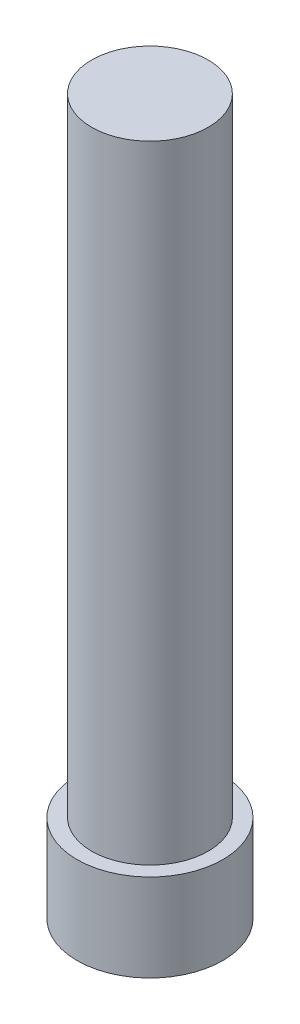
ISO-10303-21;
HEADER;
FILE_DESCRIPTION(('STEP AP214'),'2;1');
FILE_NAME('part.step','',(''),(''),'','','');
FILE_SCHEMA(('AUTOMOTIVE_DESIGN { 1 0 10303 214 1 1 1 1 }'));
ENDSEC;
DATA;
#1=APPLICATION_CONTEXT('core data for automotive mechanical design processes');
#2=APPLICATION_PROTOCOL_DEFINITION('international standard','automotive_design',2000,#1);
#3=PRODUCT_CONTEXT('',#1,'mechanical');
#4=PRODUCT('Part','Part','',(#3));
#5=PRODUCT_RELATED_PRODUCT_CATEGORY('part','',(#4));
#6=PRODUCT_DEFINITION_FORMATION('','',#4);
#7=PRODUCT_DEFINITION_CONTEXT('part definition',#1,'design');
#8=PRODUCT_DEFINITION('design','',#6,#7);
#9=PRODUCT_DEFINITION_SHAPE('','',#8);
#10=(LENGTH_UNIT() NAMED_UNIT(*) SI_UNIT(.MILLI.,.METRE.));
#11=(NAMED_UNIT(*) PLANE_ANGLE_UNIT() SI_UNIT($,.RADIAN.));
#12=(NAMED_UNIT(*) SI_UNIT($,.STERADIAN.) SOLID_ANGLE_UNIT());
#13=UNCERTAINTY_MEASURE_WITH_UNIT(LENGTH_MEASURE(1.E-05),#10,'distance_accuracy_value','');
#14=(GEOMETRIC_REPRESENTATION_CONTEXT(3) GLOBAL_UNCERTAINTY_ASSIGNED_CONTEXT((#13)) GLOBAL_UNIT_ASSIGNED_CONTEXT((#10,
#11,#12)) REPRESENTATION_CONTEXT('',''));
#15=CARTESIAN_POINT('',(0.,0.,0.));
#16=DIRECTION('',(0.,0.,1.));
#17=DIRECTION('',(1.,0.,0.));
#18=AXIS2_PLACEMENT_3D('',#15,#16,#17);
#19=CARTESIAN_POINT('',(0.,6.,0.));
#20=DIRECTION('',(0.,-1.,0.));
#21=DIRECTION('',(0.,0.,-1.));
#22=AXIS2_PLACEMENT_3D('',#19,#20,#21);
#23=CYLINDRICAL_SURFACE('',#22,5.);
#24=CARTESIAN_POINT('',(0.,6.,0.));
#25=DIRECTION('',(0.,1.,0.));
#26=DIRECTION('',(0.,0.,1.));
#27=AXIS2_PLACEMENT_3D('',#24,#25,#26);
#28=CIRCLE('',#27,5.);
#29=CARTESIAN_POINT('',(0.,6.,5.));
#30=VERTEX_POINT('',#29);
#31=EDGE_CURVE('E42',#30,#30,#28,.T.);
#32=ORIENTED_EDGE('',*,*,#31,.F.);
#33=EDGE_LOOP('',(#32));
#34=FACE_BOUND('',#33,.T.);
#35=CARTESIAN_POINT('',(0.,0.,0.));
#36=DIRECTION('',(0.,1.,0.));
#37=DIRECTION('',(0.,0.,1.));
#38=AXIS2_PLACEMENT_3D('',#35,#36,#37);
#39=CIRCLE('',#38,5.);
#40=CARTESIAN_POINT('',(0.,0.,5.));
#41=VERTEX_POINT('',#40);
#42=EDGE_CURVE('E37',#41,#41,#39,.T.);
#43=ORIENTED_EDGE('',*,*,#42,.T.);
#44=EDGE_LOOP('',(#43));
#45=FACE_BOUND('',#44,.T.);
#46=ADVANCED_FACE('F34',(#34,#45),#23,.T.);
#47=CARTESIAN_POINT('',(0.,6.,0.));
#48=DIRECTION('',(0.,1.,0.));
#49=DIRECTION('',(0.,0.,1.));
#50=AXIS2_PLACEMENT_3D('',#47,#48,#49);
#51=PLANE('',#50);
#52=CARTESIAN_POINT('',(0.,6.,0.));
#53=DIRECTION('',(0.,1.,0.));
#54=DIRECTION('',(0.,0.,1.));
#55=AXIS2_PLACEMENT_3D('',#52,#53,#54);
#56=CIRCLE('',#55,4.);
#57=CARTESIAN_POINT('',(0.,6.,4.));
#58=VERTEX_POINT('',#57);
#59=EDGE_CURVE('E11',#58,#58,#56,.T.);
#60=ORIENTED_EDGE('',*,*,#59,.F.);
#61=EDGE_LOOP('',(#60));
#62=FACE_BOUND('',#61,.T.);
#63=ORIENTED_EDGE('',*,*,#31,.T.);
#64=EDGE_LOOP('',(#63));
#65=FACE_BOUND('',#64,.T.);
#66=ADVANCED_FACE('F154',(#62,#65),#51,.T.);
#67=CARTESIAN_POINT('',(0.,0.,0.));
#68=DIRECTION('',(0.,1.,0.));
#69=DIRECTION('',(0.,0.,1.));
#70=AXIS2_PLACEMENT_3D('',#67,#68,#69);
#71=PLANE('',#70);
#72=DIRECTION('',(-0.5,0.,0.866025403784439));
#73=VECTOR('',#72,1.);
#74=CARTESIAN_POINT('',(3.46410161513776,0.,0.));
#75=LINE('',#74,#73);
#76=CARTESIAN_POINT('',(3.46410161513776,0.,0.));
#77=VERTEX_POINT('',#76);
#78=CARTESIAN_POINT('',(1.73205080756888,0.,3.));
#79=VERTEX_POINT('',#78);
#80=EDGE_CURVE('E124',#77,#79,#75,.T.);
#81=ORIENTED_EDGE('',*,*,#80,.F.);
#82=DIRECTION('',(0.5,0.,0.866025403784439));
#83=VECTOR('',#82,1.);
#84=CARTESIAN_POINT('',(1.73205080756888,0.,-3.));
#85=LINE('',#84,#83);
#86=CARTESIAN_POINT('',(1.73205080756888,0.,-3.));
#87=VERTEX_POINT('',#86);
#88=EDGE_CURVE('E50',#87,#77,#85,.T.);
#89=ORIENTED_EDGE('',*,*,#88,.F.);
#90=DIRECTION('',(1.,0.,0.));
#91=VECTOR('',#90,1.);
#92=CARTESIAN_POINT('',(-1.73205080756888,0.,-3.));
#93=LINE('',#92,#91);
#94=CARTESIAN_POINT('',(-1.73205080756888,0.,-3.));
#95=VERTEX_POINT('',#94);
#96=EDGE_CURVE('E133',#95,#87,#93,.T.);
#97=ORIENTED_EDGE('',*,*,#96,.F.);
#98=DIRECTION('',(0.5,0.,-0.866025403784439));
#99=VECTOR('',#98,1.);
#100=CARTESIAN_POINT('',(-3.46410161513776,0.,0.));
#101=LINE('',#100,#99);
#102=CARTESIAN_POINT('',(-3.46410161513776,0.,0.));
#103=VERTEX_POINT('',#102);
#104=EDGE_CURVE('E131',#103,#95,#101,.T.);
#105=ORIENTED_EDGE('',*,*,#104,.F.);
#106=DIRECTION('',(-0.5,0.,-0.866025403784439));
#107=VECTOR('',#106,1.);
#108=CARTESIAN_POINT('',(-1.73205080756888,0.,3.));
#109=LINE('',#108,#107);
#110=CARTESIAN_POINT('',(-1.73205080756888,0.,3.));
#111=VERTEX_POINT('',#110);
#112=EDGE_CURVE('E98',#111,#103,#109,.T.);
#113=ORIENTED_EDGE('',*,*,#112,.F.);
#114=DIRECTION('',(-1.,0.,0.));
#115=VECTOR('',#114,1.);
#116=CARTESIAN_POINT('',(1.73205080756888,0.,3.));
#117=LINE('',#116,#115);
#118=EDGE_CURVE('E127',#79,#111,#117,.T.);
#119=ORIENTED_EDGE('',*,*,#118,.F.);
#120=EDGE_LOOP('',(#81,#89,#97,#105,#113,#119));
#121=FACE_BOUND('',#120,.T.);
#122=ORIENTED_EDGE('',*,*,#42,.F.);
#123=EDGE_LOOP('',(#122));
#124=FACE_BOUND('',#123,.T.);
#125=ADVANCED_FACE('F151',(#121,#124),#71,.F.);
#126=CARTESIAN_POINT('',(0.,49.,0.));
#127=DIRECTION('',(0.,-1.,0.));
#128=DIRECTION('',(0.,0.,-1.));
#129=AXIS2_PLACEMENT_3D('',#126,#127,#128);
#130=CYLINDRICAL_SURFACE('',#129,4.);
#131=CARTESIAN_POINT('',(0.,49.,0.));
#132=DIRECTION('',(0.,1.,0.));
#133=DIRECTION('',(0.,0.,1.));
#134=AXIS2_PLACEMENT_3D('',#131,#132,#133);
#135=CIRCLE('',#134,4.);
#136=CARTESIAN_POINT('',(0.,49.,4.));
#137=VERTEX_POINT('',#136);
#138=EDGE_CURVE('E137',#137,#137,#135,.T.);
#139=ORIENTED_EDGE('',*,*,#138,.F.);
#140=EDGE_LOOP('',(#139));
#141=FACE_BOUND('',#140,.T.);
#142=ORIENTED_EDGE('',*,*,#59,.T.);
#143=EDGE_LOOP('',(#142));
#144=FACE_BOUND('',#143,.T.);
#145=ADVANCED_FACE('F153',(#141,#144),#130,.T.);
#146=CARTESIAN_POINT('',(0.,49.,0.));
#147=DIRECTION('',(0.,1.,0.));
#148=DIRECTION('',(0.,0.,1.));
#149=AXIS2_PLACEMENT_3D('',#146,#147,#148);
#150=PLANE('',#149);
#151=ORIENTED_EDGE('',*,*,#138,.T.);
#152=EDGE_LOOP('',(#151));
#153=FACE_BOUND('',#152,.T.);
#154=ADVANCED_FACE('F160',(#153),#150,.T.);
#155=CARTESIAN_POINT('',(1.73205080756888,3.5,-3.));
#156=DIRECTION('',(0.866025403784439,0.,-0.5));
#157=DIRECTION('',(-0.5,0.,-0.866025403784439));
#158=AXIS2_PLACEMENT_3D('',#155,#156,#157);
#159=PLANE('',#158);
#160=ORIENTED_EDGE('',*,*,#88,.T.);
#161=DIRECTION('',(0.,-1.,0.));
#162=VECTOR('',#161,1.);
#163=CARTESIAN_POINT('',(3.46410161513776,3.5,0.));
#164=LINE('',#163,#162);
#165=CARTESIAN_POINT('',(3.46410161513776,3.5,0.));
#166=VERTEX_POINT('',#165);
#167=EDGE_CURVE('E80',#166,#77,#164,.T.);
#168=ORIENTED_EDGE('',*,*,#167,.F.);
#169=DIRECTION('',(0.5,0.,0.866025403784439));
#170=VECTOR('',#169,1.);
#171=CARTESIAN_POINT('',(1.73205080756888,3.5,-3.));
#172=LINE('',#171,#170);
#173=CARTESIAN_POINT('',(1.73205080756888,3.5,-3.));
#174=VERTEX_POINT('',#173);
#175=EDGE_CURVE('E135',#174,#166,#172,.T.);
#176=ORIENTED_EDGE('',*,*,#175,.F.);
#177=DIRECTION('',(0.,-1.,0.));
#178=VECTOR('',#177,1.);
#179=CARTESIAN_POINT('',(1.73205080756888,3.5,-3.));
#180=LINE('',#179,#178);
#181=EDGE_CURVE('E58',#174,#87,#180,.T.);
#182=ORIENTED_EDGE('',*,*,#181,.T.);
#183=EDGE_LOOP('',(#160,#168,#176,#182));
#184=FACE_BOUND('',#183,.T.);
#185=ADVANCED_FACE('F189',(#184),#159,.F.);
#186=CARTESIAN_POINT('',(-1.73205080756888,3.5,-3.));
#187=DIRECTION('',(0.,0.,-1.));
#188=DIRECTION('',(-1.,0.,0.));
#189=AXIS2_PLACEMENT_3D('',#186,#187,#188);
#190=PLANE('',#189);
#191=ORIENTED_EDGE('',*,*,#96,.T.);
#192=ORIENTED_EDGE('',*,*,#181,.F.);
#193=DIRECTION('',(1.,0.,0.));
#194=VECTOR('',#193,1.);
#195=CARTESIAN_POINT('',(-1.73205080756888,3.5,-3.));
#196=LINE('',#195,#194);
#197=CARTESIAN_POINT('',(-1.73205080756888,3.5,-3.));
#198=VERTEX_POINT('',#197);
#199=EDGE_CURVE('E110',#198,#174,#196,.T.);
#200=ORIENTED_EDGE('',*,*,#199,.F.);
#201=DIRECTION('',(0.,-1.,0.));
#202=VECTOR('',#201,1.);
#203=CARTESIAN_POINT('',(-1.73205080756888,3.5,-3.));
#204=LINE('',#203,#202);
#205=EDGE_CURVE('E102',#198,#95,#204,.T.);
#206=ORIENTED_EDGE('',*,*,#205,.T.);
#207=EDGE_LOOP('',(#191,#192,#200,#206));
#208=FACE_BOUND('',#207,.T.);
#209=ADVANCED_FACE('F203',(#208),#190,.F.);
#210=CARTESIAN_POINT('',(-3.46410161513776,3.5,0.));
#211=DIRECTION('',(-0.866025403784439,0.,-0.5));
#212=DIRECTION('',(-0.5,0.,0.866025403784439));
#213=AXIS2_PLACEMENT_3D('',#210,#211,#212);
#214=PLANE('',#213);
#215=ORIENTED_EDGE('',*,*,#104,.T.);
#216=ORIENTED_EDGE('',*,*,#205,.F.);
#217=DIRECTION('',(0.5,0.,-0.866025403784439));
#218=VECTOR('',#217,1.);
#219=CARTESIAN_POINT('',(-3.46410161513776,3.5,0.));
#220=LINE('',#219,#218);
#221=CARTESIAN_POINT('',(-3.46410161513776,3.5,0.));
#222=VERTEX_POINT('',#221);
#223=EDGE_CURVE('E106',#222,#198,#220,.T.);
#224=ORIENTED_EDGE('',*,*,#223,.F.);
#225=DIRECTION('',(0.,-1.,0.));
#226=VECTOR('',#225,1.);
#227=CARTESIAN_POINT('',(-3.46410161513776,3.5,0.));
#228=LINE('',#227,#226);
#229=EDGE_CURVE('E91',#222,#103,#228,.T.);
#230=ORIENTED_EDGE('',*,*,#229,.T.);
#231=EDGE_LOOP('',(#215,#216,#224,#230));
#232=FACE_BOUND('',#231,.T.);
#233=ADVANCED_FACE('F107',(#232),#214,.F.);
#234=CARTESIAN_POINT('',(-1.73205080756888,3.5,3.));
#235=DIRECTION('',(-0.866025403784439,0.,0.5));
#236=DIRECTION('',(0.5,0.,0.866025403784439));
#237=AXIS2_PLACEMENT_3D('',#234,#235,#236);
#238=PLANE('',#237);
#239=ORIENTED_EDGE('',*,*,#112,.T.);
#240=ORIENTED_EDGE('',*,*,#229,.F.);
#241=DIRECTION('',(-0.5,0.,-0.866025403784439));
#242=VECTOR('',#241,1.);
#243=CARTESIAN_POINT('',(-1.73205080756888,3.5,3.));
#244=LINE('',#243,#242);
#245=CARTESIAN_POINT('',(-1.73205080756888,3.5,3.));
#246=VERTEX_POINT('',#245);
#247=EDGE_CURVE('E95',#246,#222,#244,.T.);
#248=ORIENTED_EDGE('',*,*,#247,.F.);
#249=DIRECTION('',(0.,-1.,0.));
#250=VECTOR('',#249,1.);
#251=CARTESIAN_POINT('',(-1.73205080756888,3.5,3.));
#252=LINE('',#251,#250);
#253=EDGE_CURVE('E103',#246,#111,#252,.T.);
#254=ORIENTED_EDGE('',*,*,#253,.T.);
#255=EDGE_LOOP('',(#239,#240,#248,#254));
#256=FACE_BOUND('',#255,.T.);
#257=ADVANCED_FACE('F93',(#256),#238,.F.);
#258=CARTESIAN_POINT('',(1.73205080756888,3.5,3.));
#259=DIRECTION('',(0.,0.,1.));
#260=DIRECTION('',(1.,0.,0.));
#261=AXIS2_PLACEMENT_3D('',#258,#259,#260);
#262=PLANE('',#261);
#263=ORIENTED_EDGE('',*,*,#118,.T.);
#264=ORIENTED_EDGE('',*,*,#253,.F.);
#265=DIRECTION('',(-1.,0.,0.));
#266=VECTOR('',#265,1.);
#267=CARTESIAN_POINT('',(1.73205080756888,3.5,3.));
#268=LINE('',#267,#266);
#269=CARTESIAN_POINT('',(1.73205080756888,3.5,3.));
#270=VERTEX_POINT('',#269);
#271=EDGE_CURVE('E116',#270,#246,#268,.T.);
#272=ORIENTED_EDGE('',*,*,#271,.F.);
#273=DIRECTION('',(0.,-1.,0.));
#274=VECTOR('',#273,1.);
#275=CARTESIAN_POINT('',(1.73205080756888,3.5,3.));
#276=LINE('',#275,#274);
#277=EDGE_CURVE('E140',#270,#79,#276,.T.);
#278=ORIENTED_EDGE('',*,*,#277,.T.);
#279=EDGE_LOOP('',(#263,#264,#272,#278));
#280=FACE_BOUND('',#279,.T.);
#281=ADVANCED_FACE('F228',(#280),#262,.F.);
#282=CARTESIAN_POINT('',(3.46410161513776,3.5,0.));
#283=DIRECTION('',(0.866025403784438,0.,0.5));
#284=DIRECTION('',(0.5,0.,-0.866025403784439));
#285=AXIS2_PLACEMENT_3D('',#282,#283,#284);
#286=PLANE('',#285);
#287=ORIENTED_EDGE('',*,*,#80,.T.);
#288=ORIENTED_EDGE('',*,*,#277,.F.);
#289=DIRECTION('',(-0.5,0.,0.866025403784439));
#290=VECTOR('',#289,1.);
#291=CARTESIAN_POINT('',(3.46410161513776,3.5,0.));
#292=LINE('',#291,#290);
#293=EDGE_CURVE('E118',#166,#270,#292,.T.);
#294=ORIENTED_EDGE('',*,*,#293,.F.);
#295=ORIENTED_EDGE('',*,*,#167,.T.);
#296=EDGE_LOOP('',(#287,#288,#294,#295));
#297=FACE_BOUND('',#296,.T.);
#298=ADVANCED_FACE('F237',(#297),#286,.F.);
#299=CARTESIAN_POINT('',(0.,3.5,0.));
#300=DIRECTION('',(0.,-1.,0.));
#301=DIRECTION('',(0.,0.,-1.));
#302=AXIS2_PLACEMENT_3D('',#299,#300,#301);
#303=PLANE('',#302);
#304=ORIENTED_EDGE('',*,*,#175,.T.);
#305=ORIENTED_EDGE('',*,*,#293,.T.);
#306=ORIENTED_EDGE('',*,*,#271,.T.);
#307=ORIENTED_EDGE('',*,*,#247,.T.);
#308=ORIENTED_EDGE('',*,*,#223,.T.);
#309=ORIENTED_EDGE('',*,*,#199,.T.);
#310=EDGE_LOOP('',(#304,#305,#306,#307,#308,#309));
#311=FACE_BOUND('',#310,.T.);
#312=ADVANCED_FACE('F113',(#311),#303,.T.);
#313=CLOSED_SHELL('',(#46,#66,#125,#145,#154,#185,#209,#233,#257,#281,#298,#312));
#314=MANIFOLD_SOLID_BREP('B2',#313);
#315=ADVANCED_BREP_SHAPE_REPRESENTATION('',(#18,#314),#14);
#316=SHAPE_DEFINITION_REPRESENTATION(#9,#315);
ENDSEC;
END-ISO-10303-21;
